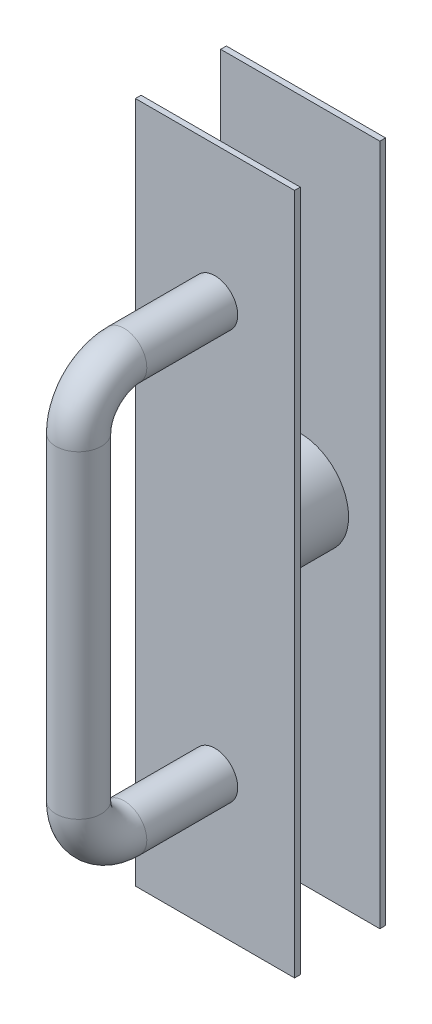
ISO-10303-21;
HEADER;
FILE_DESCRIPTION(('STEP AP214'),'2;1');
FILE_NAME('part.step','',(''),(''),'','','');
FILE_SCHEMA(('AUTOMOTIVE_DESIGN { 1 0 10303 214 1 1 1 1 }'));
ENDSEC;
DATA;
#1=APPLICATION_CONTEXT('core data for automotive mechanical design processes');
#2=APPLICATION_PROTOCOL_DEFINITION('international standard','automotive_design',2000,#1);
#3=PRODUCT_CONTEXT('',#1,'mechanical');
#4=PRODUCT('Part','Part','',(#3));
#5=PRODUCT_RELATED_PRODUCT_CATEGORY('part','',(#4));
#6=PRODUCT_DEFINITION_FORMATION('','',#4);
#7=PRODUCT_DEFINITION_CONTEXT('part definition',#1,'design');
#8=PRODUCT_DEFINITION('design','',#6,#7);
#9=PRODUCT_DEFINITION_SHAPE('','',#8);
#10=(LENGTH_UNIT() NAMED_UNIT(*) SI_UNIT(.MILLI.,.METRE.));
#11=(NAMED_UNIT(*) PLANE_ANGLE_UNIT() SI_UNIT($,.RADIAN.));
#12=(NAMED_UNIT(*) SI_UNIT($,.STERADIAN.) SOLID_ANGLE_UNIT());
#13=UNCERTAINTY_MEASURE_WITH_UNIT(LENGTH_MEASURE(1.E-05),#10,'distance_accuracy_value','');
#14=(GEOMETRIC_REPRESENTATION_CONTEXT(3) GLOBAL_UNCERTAINTY_ASSIGNED_CONTEXT((#13)) GLOBAL_UNIT_ASSIGNED_CONTEXT((#10,
#11,#12)) REPRESENTATION_CONTEXT('',''));
#15=CARTESIAN_POINT('',(0.,0.,0.));
#16=DIRECTION('',(0.,0.,1.));
#17=DIRECTION('',(1.,0.,0.));
#18=AXIS2_PLACEMENT_3D('',#15,#16,#17);
#19=CARTESIAN_POINT('',(0.,0.,3.175));
#20=DIRECTION('',(0.,0.,1.));
#21=DIRECTION('',(1.,0.,0.));
#22=AXIS2_PLACEMENT_3D('',#19,#20,#21);
#23=PLANE('',#22);
#24=DIRECTION('',(0.,-1.,0.));
#25=VECTOR('',#24,1.);
#26=CARTESIAN_POINT('',(-44.45,190.5,3.175));
#27=LINE('',#26,#25);
#28=CARTESIAN_POINT('',(-44.45,190.5,3.175));
#29=VERTEX_POINT('',#28);
#30=CARTESIAN_POINT('',(-44.45,-190.5,3.175));
#31=VERTEX_POINT('',#30);
#32=EDGE_CURVE('E159',#29,#31,#27,.T.);
#33=ORIENTED_EDGE('',*,*,#32,.T.);
#34=DIRECTION('',(1.,0.,0.));
#35=VECTOR('',#34,1.);
#36=CARTESIAN_POINT('',(-44.45,-190.5,3.175));
#37=LINE('',#36,#35);
#38=CARTESIAN_POINT('',(44.45,-190.5,3.175));
#39=VERTEX_POINT('',#38);
#40=EDGE_CURVE('E84',#31,#39,#37,.T.);
#41=ORIENTED_EDGE('',*,*,#40,.T.);
#42=DIRECTION('',(0.,1.,0.));
#43=VECTOR('',#42,1.);
#44=CARTESIAN_POINT('',(44.45,190.5,3.175));
#45=LINE('',#44,#43);
#46=CARTESIAN_POINT('',(44.45,190.5,3.175));
#47=VERTEX_POINT('',#46);
#48=EDGE_CURVE('E162',#39,#47,#45,.T.);
#49=ORIENTED_EDGE('',*,*,#48,.T.);
#50=DIRECTION('',(-1.,0.,0.));
#51=VECTOR('',#50,1.);
#52=CARTESIAN_POINT('',(-44.45,190.5,3.175));
#53=LINE('',#52,#51);
#54=EDGE_CURVE('E52',#47,#29,#53,.T.);
#55=ORIENTED_EDGE('',*,*,#54,.T.);
#56=EDGE_LOOP('',(#33,#41,#49,#55));
#57=FACE_BOUND('',#56,.T.);
#58=CARTESIAN_POINT('',(0.,-114.3,3.175));
#59=DIRECTION('',(0.,0.,1.));
#60=DIRECTION('',(1.,0.,0.));
#61=AXIS2_PLACEMENT_3D('',#58,#59,#60);
#62=CIRCLE('',#61,12.7);
#63=CARTESIAN_POINT('',(12.7,-114.3,3.175));
#64=VERTEX_POINT('',#63);
#65=EDGE_CURVE('E11',#64,#64,#62,.T.);
#66=ORIENTED_EDGE('',*,*,#65,.F.);
#67=EDGE_LOOP('',(#66));
#68=FACE_BOUND('',#67,.T.);
#69=CARTESIAN_POINT('',(0.,114.3,3.175));
#70=DIRECTION('',(0.,0.,-1.));
#71=DIRECTION('',(1.,0.,0.));
#72=AXIS2_PLACEMENT_3D('',#69,#70,#71);
#73=CIRCLE('',#72,12.7);
#74=CARTESIAN_POINT('',(12.7,114.3,3.175));
#75=VERTEX_POINT('',#74);
#76=EDGE_CURVE('E155',#75,#75,#73,.T.);
#77=ORIENTED_EDGE('',*,*,#76,.T.);
#78=EDGE_LOOP('',(#77));
#79=FACE_BOUND('',#78,.T.);
#80=ADVANCED_FACE('F34',(#57,#68,#79),#23,.T.);
#81=CARTESIAN_POINT('',(0.,0.,-44.45));
#82=DIRECTION('',(0.,0.,1.));
#83=DIRECTION('',(1.,0.,0.));
#84=AXIS2_PLACEMENT_3D('',#81,#82,#83);
#85=CYLINDRICAL_SURFACE('',#84,26.9875);
#86=CARTESIAN_POINT('',(0.,0.,-44.45));
#87=DIRECTION('',(0.,0.,1.));
#88=DIRECTION('',(1.,0.,0.));
#89=AXIS2_PLACEMENT_3D('',#86,#87,#88);
#90=CIRCLE('',#89,26.9875);
#91=CARTESIAN_POINT('',(26.9875,0.,-44.45));
#92=VERTEX_POINT('',#91);
#93=EDGE_CURVE('E136',#92,#92,#90,.T.);
#94=ORIENTED_EDGE('',*,*,#93,.T.);
#95=EDGE_LOOP('',(#94));
#96=FACE_BOUND('',#95,.T.);
#97=CARTESIAN_POINT('',(0.,0.,0.));
#98=DIRECTION('',(0.,0.,1.));
#99=DIRECTION('',(1.,0.,0.));
#100=AXIS2_PLACEMENT_3D('',#97,#98,#99);
#101=CIRCLE('',#100,26.9875);
#102=CARTESIAN_POINT('',(26.9875,0.,0.));
#103=VERTEX_POINT('',#102);
#104=EDGE_CURVE('E38',#103,#103,#101,.T.);
#105=ORIENTED_EDGE('',*,*,#104,.F.);
#106=EDGE_LOOP('',(#105));
#107=FACE_BOUND('',#106,.T.);
#108=ADVANCED_FACE('F36',(#96,#107),#85,.T.);
#109=CARTESIAN_POINT('',(-44.45,190.5,3.175));
#110=DIRECTION('',(1.,0.,0.));
#111=DIRECTION('',(0.,1.,0.));
#112=AXIS2_PLACEMENT_3D('',#109,#110,#111);
#113=PLANE('',#112);
#114=DIRECTION('',(0.,-1.,0.));
#115=VECTOR('',#114,1.);
#116=CARTESIAN_POINT('',(-44.45,190.5,0.));
#117=LINE('',#116,#115);
#118=CARTESIAN_POINT('',(-44.45,190.5,0.));
#119=VERTEX_POINT('',#118);
#120=CARTESIAN_POINT('',(-44.45,-190.5,0.));
#121=VERTEX_POINT('',#120);
#122=EDGE_CURVE('E158',#119,#121,#117,.T.);
#123=ORIENTED_EDGE('',*,*,#122,.T.);
#124=DIRECTION('',(0.,0.,-1.));
#125=VECTOR('',#124,1.);
#126=CARTESIAN_POINT('',(-44.45,-190.5,3.175));
#127=LINE('',#126,#125);
#128=EDGE_CURVE('E177',#31,#121,#127,.T.);
#129=ORIENTED_EDGE('',*,*,#128,.F.);
#130=ORIENTED_EDGE('',*,*,#32,.F.);
#131=DIRECTION('',(0.,0.,-1.));
#132=VECTOR('',#131,1.);
#133=CARTESIAN_POINT('',(-44.45,190.5,3.175));
#134=LINE('',#133,#132);
#135=EDGE_CURVE('E165',#29,#119,#134,.T.);
#136=ORIENTED_EDGE('',*,*,#135,.T.);
#137=EDGE_LOOP('',(#123,#129,#130,#136));
#138=FACE_BOUND('',#137,.T.);
#139=ADVANCED_FACE('F186',(#138),#113,.F.);
#140=CARTESIAN_POINT('',(-44.45,-190.5,3.175));
#141=DIRECTION('',(0.,1.,0.));
#142=DIRECTION('',(0.,0.,1.));
#143=AXIS2_PLACEMENT_3D('',#140,#141,#142);
#144=PLANE('',#143);
#145=DIRECTION('',(1.,0.,0.));
#146=VECTOR('',#145,1.);
#147=CARTESIAN_POINT('',(-44.45,-190.5,0.));
#148=LINE('',#147,#146);
#149=CARTESIAN_POINT('',(44.45,-190.5,0.));
#150=VERTEX_POINT('',#149);
#151=EDGE_CURVE('E168',#121,#150,#148,.T.);
#152=ORIENTED_EDGE('',*,*,#151,.T.);
#153=DIRECTION('',(0.,0.,-1.));
#154=VECTOR('',#153,1.);
#155=CARTESIAN_POINT('',(44.45,-190.5,3.175));
#156=LINE('',#155,#154);
#157=EDGE_CURVE('E175',#39,#150,#156,.T.);
#158=ORIENTED_EDGE('',*,*,#157,.F.);
#159=ORIENTED_EDGE('',*,*,#40,.F.);
#160=ORIENTED_EDGE('',*,*,#128,.T.);
#161=EDGE_LOOP('',(#152,#158,#159,#160));
#162=FACE_BOUND('',#161,.T.);
#163=ADVANCED_FACE('F192',(#162),#144,.F.);
#164=CARTESIAN_POINT('',(44.45,190.5,3.175));
#165=DIRECTION('',(-1.,0.,0.));
#166=DIRECTION('',(0.,-1.,0.));
#167=AXIS2_PLACEMENT_3D('',#164,#165,#166);
#168=PLANE('',#167);
#169=DIRECTION('',(0.,1.,0.));
#170=VECTOR('',#169,1.);
#171=CARTESIAN_POINT('',(44.45,190.5,0.));
#172=LINE('',#171,#170);
#173=CARTESIAN_POINT('',(44.45,190.5,0.));
#174=VERTEX_POINT('',#173);
#175=EDGE_CURVE('E70',#150,#174,#172,.T.);
#176=ORIENTED_EDGE('',*,*,#175,.T.);
#177=DIRECTION('',(0.,0.,-1.));
#178=VECTOR('',#177,1.);
#179=CARTESIAN_POINT('',(44.45,190.5,3.175));
#180=LINE('',#179,#178);
#181=EDGE_CURVE('E173',#47,#174,#180,.T.);
#182=ORIENTED_EDGE('',*,*,#181,.F.);
#183=ORIENTED_EDGE('',*,*,#48,.F.);
#184=ORIENTED_EDGE('',*,*,#157,.T.);
#185=EDGE_LOOP('',(#176,#182,#183,#184));
#186=FACE_BOUND('',#185,.T.);
#187=ADVANCED_FACE('F255',(#186),#168,.F.);
#188=CARTESIAN_POINT('',(-44.45,190.5,3.175));
#189=DIRECTION('',(0.,-1.,0.));
#190=DIRECTION('',(1.,0.,0.));
#191=AXIS2_PLACEMENT_3D('',#188,#189,#190);
#192=PLANE('',#191);
#193=DIRECTION('',(-1.,0.,0.));
#194=VECTOR('',#193,1.);
#195=CARTESIAN_POINT('',(-44.45,190.5,0.));
#196=LINE('',#195,#194);
#197=EDGE_CURVE('E76',#174,#119,#196,.T.);
#198=ORIENTED_EDGE('',*,*,#197,.T.);
#199=ORIENTED_EDGE('',*,*,#135,.F.);
#200=ORIENTED_EDGE('',*,*,#54,.F.);
#201=ORIENTED_EDGE('',*,*,#181,.T.);
#202=EDGE_LOOP('',(#198,#199,#200,#201));
#203=FACE_BOUND('',#202,.T.);
#204=ADVANCED_FACE('F252',(#203),#192,.F.);
#205=CARTESIAN_POINT('',(0.,0.,0.));
#206=DIRECTION('',(0.,0.,1.));
#207=DIRECTION('',(1.,0.,0.));
#208=AXIS2_PLACEMENT_3D('',#205,#206,#207);
#209=PLANE('',#208);
#210=ORIENTED_EDGE('',*,*,#104,.T.);
#211=EDGE_LOOP('',(#210));
#212=FACE_BOUND('',#211,.T.);
#213=ORIENTED_EDGE('',*,*,#122,.F.);
#214=ORIENTED_EDGE('',*,*,#197,.F.);
#215=ORIENTED_EDGE('',*,*,#175,.F.);
#216=ORIENTED_EDGE('',*,*,#151,.F.);
#217=EDGE_LOOP('',(#213,#214,#215,#216));
#218=FACE_BOUND('',#217,.T.);
#219=ADVANCED_FACE('F182',(#212,#218),#209,.F.);
#220=CARTESIAN_POINT('',(0.,-114.3,3.175));
#221=DIRECTION('',(0.,0.,1.));
#222=DIRECTION('',(0.,-1.,0.));
#223=AXIS2_PLACEMENT_3D('',#220,#221,#222);
#224=CYLINDRICAL_SURFACE('',#223,12.7);
#225=CARTESIAN_POINT('',(0.,-114.3,53.975));
#226=DIRECTION('',(0.,0.,1.));
#227=DIRECTION('',(1.,0.,0.));
#228=AXIS2_PLACEMENT_3D('',#225,#226,#227);
#229=CIRCLE('',#228,12.7);
#230=CARTESIAN_POINT('',(0.,-127.,53.975));
#231=VERTEX_POINT('',#230);
#232=EDGE_CURVE('E139',#231,#231,#229,.T.);
#233=ORIENTED_EDGE('',*,*,#232,.F.);
#234=EDGE_LOOP('',(#233));
#235=FACE_BOUND('',#234,.T.);
#236=ORIENTED_EDGE('',*,*,#65,.T.);
#237=EDGE_LOOP('',(#236));
#238=FACE_BOUND('',#237,.T.);
#239=ADVANCED_FACE('F231',(#235,#238),#224,.T.);
#240=CARTESIAN_POINT('',(0.,-88.9,53.975));
#241=DIRECTION('',(-1.,0.,0.));
#242=DIRECTION('',(0.,0.,1.));
#243=AXIS2_PLACEMENT_3D('',#240,#241,#242);
#244=TOROIDAL_SURFACE('',#243,25.4,12.7);
#245=CARTESIAN_POINT('',(0.,-88.9,79.375));
#246=DIRECTION('',(0.,1.,0.));
#247=DIRECTION('',(1.,0.,0.));
#248=AXIS2_PLACEMENT_3D('',#245,#246,#247);
#249=CIRCLE('',#248,12.7);
#250=CARTESIAN_POINT('',(0.,-88.9,92.075));
#251=VERTEX_POINT('',#250);
#252=EDGE_CURVE('E146',#251,#251,#249,.T.);
#253=CARTESIAN_POINT('',(0.,-88.9,53.975));
#254=DIRECTION('',(-1.,0.,0.));
#255=DIRECTION('',(0.,0.,1.));
#256=AXIS2_PLACEMENT_3D('',#253,#254,#255);
#257=CIRCLE('',#256,38.1);
#258=EDGE_CURVE('',#231,#251,#257,.T.);
#259=ORIENTED_EDGE('',*,*,#232,.T.);
#260=ORIENTED_EDGE('',*,*,#252,.F.);
#261=ORIENTED_EDGE('',*,*,#258,.T.);
#262=ORIENTED_EDGE('',*,*,#258,.F.);
#263=EDGE_LOOP('',(#259,#261,#260,#262));
#264=FACE_BOUND('',#263,.T.);
#265=ADVANCED_FACE('F234',(#264),#244,.T.);
#266=CARTESIAN_POINT('',(0.,-88.9,79.375));
#267=DIRECTION('',(0.,1.,0.));
#268=DIRECTION('',(0.,0.,1.));
#269=AXIS2_PLACEMENT_3D('',#266,#267,#268);
#270=CYLINDRICAL_SURFACE('',#269,12.7);
#271=CARTESIAN_POINT('',(0.,88.9,79.375));
#272=DIRECTION('',(0.,1.,0.));
#273=DIRECTION('',(1.,0.,0.));
#274=AXIS2_PLACEMENT_3D('',#271,#272,#273);
#275=CIRCLE('',#274,12.7);
#276=CARTESIAN_POINT('',(0.,88.9,92.075));
#277=VERTEX_POINT('',#276);
#278=EDGE_CURVE('E149',#277,#277,#275,.T.);
#279=ORIENTED_EDGE('',*,*,#278,.F.);
#280=EDGE_LOOP('',(#279));
#281=FACE_BOUND('',#280,.T.);
#282=ORIENTED_EDGE('',*,*,#252,.T.);
#283=EDGE_LOOP('',(#282));
#284=FACE_BOUND('',#283,.T.);
#285=ADVANCED_FACE('F238',(#281,#284),#270,.T.);
#286=CARTESIAN_POINT('',(0.,88.9,53.975));
#287=DIRECTION('',(-1.,0.,0.));
#288=DIRECTION('',(0.,0.,1.));
#289=AXIS2_PLACEMENT_3D('',#286,#287,#288);
#290=TOROIDAL_SURFACE('',#289,25.4,12.7);
#291=CARTESIAN_POINT('',(0.,114.3,53.975));
#292=DIRECTION('',(0.,0.,-1.));
#293=DIRECTION('',(1.,0.,0.));
#294=AXIS2_PLACEMENT_3D('',#291,#292,#293);
#295=CIRCLE('',#294,12.7);
#296=CARTESIAN_POINT('',(0.,127.,53.975));
#297=VERTEX_POINT('',#296);
#298=EDGE_CURVE('E152',#297,#297,#295,.T.);
#299=CARTESIAN_POINT('',(0.,88.9,53.975));
#300=DIRECTION('',(-1.,0.,0.));
#301=DIRECTION('',(0.,0.,1.));
#302=AXIS2_PLACEMENT_3D('',#299,#300,#301);
#303=CIRCLE('',#302,38.1);
#304=EDGE_CURVE('',#277,#297,#303,.T.);
#305=ORIENTED_EDGE('',*,*,#278,.T.);
#306=ORIENTED_EDGE('',*,*,#298,.F.);
#307=ORIENTED_EDGE('',*,*,#304,.T.);
#308=ORIENTED_EDGE('',*,*,#304,.F.);
#309=EDGE_LOOP('',(#305,#307,#306,#308));
#310=FACE_BOUND('',#309,.T.);
#311=ADVANCED_FACE('F242',(#310),#290,.T.);
#312=CARTESIAN_POINT('',(0.,114.3,53.975));
#313=DIRECTION('',(0.,0.,-1.));
#314=DIRECTION('',(0.,1.,0.));
#315=AXIS2_PLACEMENT_3D('',#312,#313,#314);
#316=CYLINDRICAL_SURFACE('',#315,12.7);
#317=ORIENTED_EDGE('',*,*,#76,.F.);
#318=EDGE_LOOP('',(#317));
#319=FACE_BOUND('',#318,.T.);
#320=ORIENTED_EDGE('',*,*,#298,.T.);
#321=EDGE_LOOP('',(#320));
#322=FACE_BOUND('',#321,.T.);
#323=ADVANCED_FACE('F230',(#319,#322),#316,.T.);
#324=CARTESIAN_POINT('',(-44.45,190.5,-47.625));
#325=DIRECTION('',(1.,0.,0.));
#326=DIRECTION('',(0.,1.,0.));
#327=AXIS2_PLACEMENT_3D('',#324,#325,#326);
#328=PLANE('',#327);
#329=DIRECTION('',(0.,1.,0.));
#330=VECTOR('',#329,1.);
#331=CARTESIAN_POINT('',(-44.45,190.5,-44.45));
#332=LINE('',#331,#330);
#333=CARTESIAN_POINT('',(-44.45,-190.5,-44.45));
#334=VERTEX_POINT('',#333);
#335=CARTESIAN_POINT('',(-44.45,190.5,-44.45));
#336=VERTEX_POINT('',#335);
#337=EDGE_CURVE('E135',#334,#336,#332,.T.);
#338=ORIENTED_EDGE('',*,*,#337,.T.);
#339=DIRECTION('',(0.,0.,1.));
#340=VECTOR('',#339,1.);
#341=CARTESIAN_POINT('',(-44.45,190.5,-47.625));
#342=LINE('',#341,#340);
#343=CARTESIAN_POINT('',(-44.45,190.5,-47.625));
#344=VERTEX_POINT('',#343);
#345=EDGE_CURVE('E115',#344,#336,#342,.T.);
#346=ORIENTED_EDGE('',*,*,#345,.F.);
#347=DIRECTION('',(0.,1.,0.));
#348=VECTOR('',#347,1.);
#349=CARTESIAN_POINT('',(-44.45,190.5,-47.625));
#350=LINE('',#349,#348);
#351=CARTESIAN_POINT('',(-44.45,-190.5,-47.625));
#352=VERTEX_POINT('',#351);
#353=EDGE_CURVE('E122',#352,#344,#350,.T.);
#354=ORIENTED_EDGE('',*,*,#353,.F.);
#355=DIRECTION('',(0.,0.,1.));
#356=VECTOR('',#355,1.);
#357=CARTESIAN_POINT('',(-44.45,-190.5,-47.625));
#358=LINE('',#357,#356);
#359=EDGE_CURVE('E212',#352,#334,#358,.T.);
#360=ORIENTED_EDGE('',*,*,#359,.T.);
#361=EDGE_LOOP('',(#338,#346,#354,#360));
#362=FACE_BOUND('',#361,.T.);
#363=ADVANCED_FACE('F133',(#362),#328,.F.);
#364=CARTESIAN_POINT('',(-44.45,190.5,-47.625));
#365=DIRECTION('',(0.,-1.,0.));
#366=DIRECTION('',(0.,0.,-1.));
#367=AXIS2_PLACEMENT_3D('',#364,#365,#366);
#368=PLANE('',#367);
#369=DIRECTION('',(1.,0.,0.));
#370=VECTOR('',#369,1.);
#371=CARTESIAN_POINT('',(-44.45,190.5,-44.45));
#372=LINE('',#371,#370);
#373=CARTESIAN_POINT('',(44.45,190.5,-44.45));
#374=VERTEX_POINT('',#373);
#375=EDGE_CURVE('E203',#336,#374,#372,.T.);
#376=ORIENTED_EDGE('',*,*,#375,.T.);
#377=DIRECTION('',(0.,0.,1.));
#378=VECTOR('',#377,1.);
#379=CARTESIAN_POINT('',(44.45,190.5,-47.625));
#380=LINE('',#379,#378);
#381=CARTESIAN_POINT('',(44.45,190.5,-47.625));
#382=VERTEX_POINT('',#381);
#383=EDGE_CURVE('E118',#382,#374,#380,.T.);
#384=ORIENTED_EDGE('',*,*,#383,.F.);
#385=DIRECTION('',(1.,0.,0.));
#386=VECTOR('',#385,1.);
#387=CARTESIAN_POINT('',(-44.45,190.5,-47.625));
#388=LINE('',#387,#386);
#389=EDGE_CURVE('E111',#344,#382,#388,.T.);
#390=ORIENTED_EDGE('',*,*,#389,.F.);
#391=ORIENTED_EDGE('',*,*,#345,.T.);
#392=EDGE_LOOP('',(#376,#384,#390,#391));
#393=FACE_BOUND('',#392,.T.);
#394=ADVANCED_FACE('F113',(#393),#368,.F.);
#395=CARTESIAN_POINT('',(44.45,190.5,-47.625));
#396=DIRECTION('',(-1.,0.,0.));
#397=DIRECTION('',(0.,-1.,0.));
#398=AXIS2_PLACEMENT_3D('',#395,#396,#397);
#399=PLANE('',#398);
#400=DIRECTION('',(0.,-1.,0.));
#401=VECTOR('',#400,1.);
#402=CARTESIAN_POINT('',(44.45,190.5,-44.45));
#403=LINE('',#402,#401);
#404=CARTESIAN_POINT('',(44.45,-190.5,-44.45));
#405=VERTEX_POINT('',#404);
#406=EDGE_CURVE('E205',#374,#405,#403,.T.);
#407=ORIENTED_EDGE('',*,*,#406,.T.);
#408=DIRECTION('',(0.,0.,1.));
#409=VECTOR('',#408,1.);
#410=CARTESIAN_POINT('',(44.45,-190.5,-47.625));
#411=LINE('',#410,#409);
#412=CARTESIAN_POINT('',(44.45,-190.5,-47.625));
#413=VERTEX_POINT('',#412);
#414=EDGE_CURVE('E140',#413,#405,#411,.T.);
#415=ORIENTED_EDGE('',*,*,#414,.F.);
#416=DIRECTION('',(0.,-1.,0.));
#417=VECTOR('',#416,1.);
#418=CARTESIAN_POINT('',(44.45,190.5,-47.625));
#419=LINE('',#418,#417);
#420=EDGE_CURVE('E121',#382,#413,#419,.T.);
#421=ORIENTED_EDGE('',*,*,#420,.F.);
#422=ORIENTED_EDGE('',*,*,#383,.T.);
#423=EDGE_LOOP('',(#407,#415,#421,#422));
#424=FACE_BOUND('',#423,.T.);
#425=ADVANCED_FACE('F218',(#424),#399,.F.);
#426=CARTESIAN_POINT('',(-44.45,-190.5,-47.625));
#427=DIRECTION('',(0.,1.,0.));
#428=DIRECTION('',(0.,0.,1.));
#429=AXIS2_PLACEMENT_3D('',#426,#427,#428);
#430=PLANE('',#429);
#431=DIRECTION('',(-1.,0.,0.));
#432=VECTOR('',#431,1.);
#433=CARTESIAN_POINT('',(-44.45,-190.5,-44.45));
#434=LINE('',#433,#432);
#435=EDGE_CURVE('E131',#405,#334,#434,.T.);
#436=ORIENTED_EDGE('',*,*,#435,.T.);
#437=ORIENTED_EDGE('',*,*,#359,.F.);
#438=DIRECTION('',(-1.,0.,0.));
#439=VECTOR('',#438,1.);
#440=CARTESIAN_POINT('',(-44.45,-190.5,-47.625));
#441=LINE('',#440,#439);
#442=EDGE_CURVE('E127',#413,#352,#441,.T.);
#443=ORIENTED_EDGE('',*,*,#442,.F.);
#444=ORIENTED_EDGE('',*,*,#414,.T.);
#445=EDGE_LOOP('',(#436,#437,#443,#444));
#446=FACE_BOUND('',#445,.T.);
#447=ADVANCED_FACE('F216',(#446),#430,.F.);
#448=CARTESIAN_POINT('',(0.,0.,-47.625));
#449=DIRECTION('',(0.,0.,1.));
#450=DIRECTION('',(1.,0.,0.));
#451=AXIS2_PLACEMENT_3D('',#448,#449,#450);
#452=PLANE('',#451);
#453=ORIENTED_EDGE('',*,*,#353,.T.);
#454=ORIENTED_EDGE('',*,*,#389,.T.);
#455=ORIENTED_EDGE('',*,*,#420,.T.);
#456=ORIENTED_EDGE('',*,*,#442,.T.);
#457=EDGE_LOOP('',(#453,#454,#455,#456));
#458=FACE_BOUND('',#457,.T.);
#459=ADVANCED_FACE('F125',(#458),#452,.F.);
#460=CARTESIAN_POINT('',(0.,0.,-44.45));
#461=DIRECTION('',(0.,0.,1.));
#462=DIRECTION('',(1.,0.,0.));
#463=AXIS2_PLACEMENT_3D('',#460,#461,#462);
#464=PLANE('',#463);
#465=ORIENTED_EDGE('',*,*,#93,.F.);
#466=EDGE_LOOP('',(#465));
#467=FACE_BOUND('',#466,.T.);
#468=ORIENTED_EDGE('',*,*,#337,.F.);
#469=ORIENTED_EDGE('',*,*,#435,.F.);
#470=ORIENTED_EDGE('',*,*,#406,.F.);
#471=ORIENTED_EDGE('',*,*,#375,.F.);
#472=EDGE_LOOP('',(#468,#469,#470,#471));
#473=FACE_BOUND('',#472,.T.);
#474=ADVANCED_FACE('F197',(#467,#473),#464,.T.);
#475=CLOSED_SHELL('',(#80,#108,#139,#163,#187,#204,#219,#239,#265,#285,#311,#323,#363,#394,#425,
#447,#459,#474));
#476=MANIFOLD_SOLID_BREP('B2',#475);
#477=ADVANCED_BREP_SHAPE_REPRESENTATION('',(#18,#476),#14);
#478=SHAPE_DEFINITION_REPRESENTATION(#9,#477);
ENDSEC;
END-ISO-10303-21;
